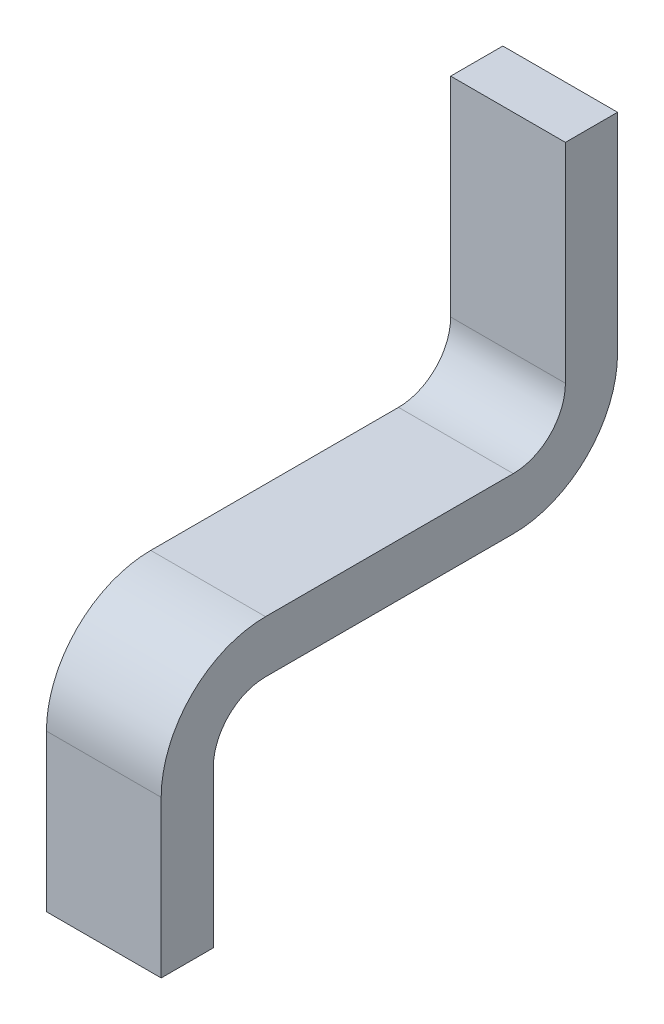
ISO-10303-21;
HEADER;
FILE_DESCRIPTION(('STEP AP214'),'2;1');
FILE_NAME('part.step','',(''),(''),'','','');
FILE_SCHEMA(('AUTOMOTIVE_DESIGN { 1 0 10303 214 1 1 1 1 }'));
ENDSEC;
DATA;
#1=APPLICATION_CONTEXT('core data for automotive mechanical design processes');
#2=APPLICATION_PROTOCOL_DEFINITION('international standard','automotive_design',2000,#1);
#3=PRODUCT_CONTEXT('',#1,'mechanical');
#4=PRODUCT('Part','Part','',(#3));
#5=PRODUCT_RELATED_PRODUCT_CATEGORY('part','',(#4));
#6=PRODUCT_DEFINITION_FORMATION('','',#4);
#7=PRODUCT_DEFINITION_CONTEXT('part definition',#1,'design');
#8=PRODUCT_DEFINITION('design','',#6,#7);
#9=PRODUCT_DEFINITION_SHAPE('','',#8);
#10=(LENGTH_UNIT() NAMED_UNIT(*) SI_UNIT(.MILLI.,.METRE.));
#11=(NAMED_UNIT(*) PLANE_ANGLE_UNIT() SI_UNIT($,.RADIAN.));
#12=(NAMED_UNIT(*) SI_UNIT($,.STERADIAN.) SOLID_ANGLE_UNIT());
#13=UNCERTAINTY_MEASURE_WITH_UNIT(LENGTH_MEASURE(1.E-05),#10,'distance_accuracy_value','');
#14=(GEOMETRIC_REPRESENTATION_CONTEXT(3) GLOBAL_UNCERTAINTY_ASSIGNED_CONTEXT((#13)) GLOBAL_UNIT_ASSIGNED_CONTEXT((#10,
#11,#12)) REPRESENTATION_CONTEXT('',''));
#15=CARTESIAN_POINT('',(0.,0.,0.));
#16=DIRECTION('',(0.,0.,1.));
#17=DIRECTION('',(1.,0.,0.));
#18=AXIS2_PLACEMENT_3D('',#15,#16,#17);
#19=CARTESIAN_POINT('',(2.36,4.,0.675));
#20=DIRECTION('',(-1.,0.,0.));
#21=DIRECTION('',(0.,-1.,0.));
#22=AXIS2_PLACEMENT_3D('',#19,#20,#21);
#23=PLANE('',#22);
#24=CARTESIAN_POINT('',(2.36,3.8,0.675));
#25=DIRECTION('',(1.,0.,0.));
#26=DIRECTION('',(0.,1.,0.));
#27=AXIS2_PLACEMENT_3D('',#24,#25,#26);
#28=CIRCLE('',#27,0.2);
#29=CARTESIAN_POINT('',(2.36,3.8,0.875));
#30=VERTEX_POINT('',#29);
#31=CARTESIAN_POINT('',(2.36,4.,0.675));
#32=VERTEX_POINT('',#31);
#33=EDGE_CURVE('E150',#30,#32,#28,.F.);
#34=ORIENTED_EDGE('',*,*,#33,.F.);
#35=DIRECTION('',(0.,1.,0.));
#36=VECTOR('',#35,1.);
#37=CARTESIAN_POINT('',(2.36,3.5,0.875));
#38=LINE('',#37,#36);
#39=CARTESIAN_POINT('',(2.36,3.5,0.875));
#40=VERTEX_POINT('',#39);
#41=EDGE_CURVE('E147',#30,#40,#38,.F.);
#42=ORIENTED_EDGE('',*,*,#41,.T.);
#43=DIRECTION('',(0.,0.,1.));
#44=VECTOR('',#43,1.);
#45=CARTESIAN_POINT('',(2.36,3.5,0.775));
#46=LINE('',#45,#44);
#47=CARTESIAN_POINT('',(2.36,3.5,0.775));
#48=VERTEX_POINT('',#47);
#49=EDGE_CURVE('E141',#48,#40,#46,.T.);
#50=ORIENTED_EDGE('',*,*,#49,.F.);
#51=DIRECTION('',(0.,1.,0.));
#52=VECTOR('',#51,1.);
#53=CARTESIAN_POINT('',(2.36,3.5,0.775));
#54=LINE('',#53,#52);
#55=CARTESIAN_POINT('',(2.36,3.8,0.775));
#56=VERTEX_POINT('',#55);
#57=EDGE_CURVE('E115',#48,#56,#54,.T.);
#58=ORIENTED_EDGE('',*,*,#57,.T.);
#59=CARTESIAN_POINT('',(2.36,3.8,0.675));
#60=DIRECTION('',(1.,0.,0.));
#61=DIRECTION('',(0.,1.,0.));
#62=AXIS2_PLACEMENT_3D('',#59,#60,#61);
#63=CIRCLE('',#62,0.1);
#64=CARTESIAN_POINT('',(2.36,3.9,0.675));
#65=VERTEX_POINT('',#64);
#66=EDGE_CURVE('E215',#56,#65,#63,.F.);
#67=ORIENTED_EDGE('',*,*,#66,.T.);
#68=DIRECTION('',(0.,0.,1.));
#69=VECTOR('',#68,1.);
#70=CARTESIAN_POINT('',(2.36,3.9,0.675));
#71=LINE('',#70,#69);
#72=CARTESIAN_POINT('',(2.36,3.9,0.2));
#73=VERTEX_POINT('',#72);
#74=EDGE_CURVE('E181',#65,#73,#71,.F.);
#75=ORIENTED_EDGE('',*,*,#74,.T.);
#76=CARTESIAN_POINT('',(2.36,4.1,0.2));
#77=DIRECTION('',(-1.,0.,0.));
#78=DIRECTION('',(0.,-1.,0.));
#79=AXIS2_PLACEMENT_3D('',#76,#77,#78);
#80=CIRCLE('',#79,0.2);
#81=CARTESIAN_POINT('',(2.36,4.1,0.));
#82=VERTEX_POINT('',#81);
#83=EDGE_CURVE('E20',#82,#73,#80,.T.);
#84=ORIENTED_EDGE('',*,*,#83,.F.);
#85=DIRECTION('',(0.,1.,0.));
#86=VECTOR('',#85,1.);
#87=CARTESIAN_POINT('',(2.36,4.1,0.));
#88=LINE('',#87,#86);
#89=CARTESIAN_POINT('',(2.36,4.5,0.));
#90=VERTEX_POINT('',#89);
#91=EDGE_CURVE('E91',#82,#90,#88,.T.);
#92=ORIENTED_EDGE('',*,*,#91,.T.);
#93=DIRECTION('',(0.,0.,1.));
#94=VECTOR('',#93,1.);
#95=CARTESIAN_POINT('',(2.36,4.5,0.));
#96=LINE('',#95,#94);
#97=CARTESIAN_POINT('',(2.36,4.5,0.1));
#98=VERTEX_POINT('',#97);
#99=EDGE_CURVE('E163',#90,#98,#96,.T.);
#100=ORIENTED_EDGE('',*,*,#99,.T.);
#101=DIRECTION('',(0.,1.,0.));
#102=VECTOR('',#101,1.);
#103=CARTESIAN_POINT('',(2.36,4.1,0.1));
#104=LINE('',#103,#102);
#105=CARTESIAN_POINT('',(2.36,4.1,0.1));
#106=VERTEX_POINT('',#105);
#107=EDGE_CURVE('E159',#98,#106,#104,.F.);
#108=ORIENTED_EDGE('',*,*,#107,.T.);
#109=CARTESIAN_POINT('',(2.36,4.1,0.2));
#110=DIRECTION('',(-1.,0.,0.));
#111=DIRECTION('',(0.,-1.,0.));
#112=AXIS2_PLACEMENT_3D('',#109,#110,#111);
#113=CIRCLE('',#112,0.1);
#114=CARTESIAN_POINT('',(2.36,4.,0.2));
#115=VERTEX_POINT('',#114);
#116=EDGE_CURVE('E155',#106,#115,#113,.T.);
#117=ORIENTED_EDGE('',*,*,#116,.T.);
#118=DIRECTION('',(0.,0.,1.));
#119=VECTOR('',#118,1.);
#120=CARTESIAN_POINT('',(2.36,4.,0.675));
#121=LINE('',#120,#119);
#122=EDGE_CURVE('E154',#115,#32,#121,.T.);
#123=ORIENTED_EDGE('',*,*,#122,.T.);
#124=EDGE_LOOP('',(#34,#42,#50,#58,#67,#75,#84,#92,#100,#108,#117,#123));
#125=FACE_BOUND('',#124,.T.);
#126=ADVANCED_FACE('F17',(#125),#23,.F.);
#127=CARTESIAN_POINT('',(2.36,4.1,0.2));
#128=DIRECTION('',(-1.,0.,0.));
#129=DIRECTION('',(0.,-1.,0.));
#130=AXIS2_PLACEMENT_3D('',#127,#128,#129);
#131=CYLINDRICAL_SURFACE('',#130,0.2);
#132=CARTESIAN_POINT('',(2.14,4.1,0.2));
#133=DIRECTION('',(-1.,0.,0.));
#134=DIRECTION('',(0.,-1.,0.));
#135=AXIS2_PLACEMENT_3D('',#132,#133,#134);
#136=CIRCLE('',#135,0.2);
#137=CARTESIAN_POINT('',(2.14,3.9,0.2));
#138=VERTEX_POINT('',#137);
#139=CARTESIAN_POINT('',(2.14,4.1,0.));
#140=VERTEX_POINT('',#139);
#141=EDGE_CURVE('E183',#138,#140,#136,.F.);
#142=ORIENTED_EDGE('',*,*,#141,.T.);
#143=DIRECTION('',(1.,0.,0.));
#144=VECTOR('',#143,1.);
#145=CARTESIAN_POINT('',(2.36,4.1,0.));
#146=LINE('',#145,#144);
#147=EDGE_CURVE('E178',#140,#82,#146,.T.);
#148=ORIENTED_EDGE('',*,*,#147,.T.);
#149=ORIENTED_EDGE('',*,*,#83,.T.);
#150=DIRECTION('',(-1.,0.,0.));
#151=VECTOR('',#150,1.);
#152=CARTESIAN_POINT('',(2.36,3.9,0.2));
#153=LINE('',#152,#151);
#154=EDGE_CURVE('E217',#73,#138,#153,.T.);
#155=ORIENTED_EDGE('',*,*,#154,.T.);
#156=EDGE_LOOP('',(#142,#148,#149,#155));
#157=FACE_BOUND('',#156,.T.);
#158=ADVANCED_FACE('F254',(#157),#131,.T.);
#159=CARTESIAN_POINT('',(2.36,4.1,0.));
#160=DIRECTION('',(0.,0.,1.));
#161=DIRECTION('',(1.,0.,0.));
#162=AXIS2_PLACEMENT_3D('',#159,#160,#161);
#163=PLANE('',#162);
#164=ORIENTED_EDGE('',*,*,#147,.F.);
#165=DIRECTION('',(0.,1.,0.));
#166=VECTOR('',#165,1.);
#167=CARTESIAN_POINT('',(2.14,3.9,0.));
#168=LINE('',#167,#166);
#169=CARTESIAN_POINT('',(2.14,4.5,0.));
#170=VERTEX_POINT('',#169);
#171=EDGE_CURVE('E170',#140,#170,#168,.T.);
#172=ORIENTED_EDGE('',*,*,#171,.T.);
#173=DIRECTION('',(1.,0.,0.));
#174=VECTOR('',#173,1.);
#175=CARTESIAN_POINT('',(2.36,4.5,0.));
#176=LINE('',#175,#174);
#177=EDGE_CURVE('E173',#170,#90,#176,.T.);
#178=ORIENTED_EDGE('',*,*,#177,.T.);
#179=ORIENTED_EDGE('',*,*,#91,.F.);
#180=EDGE_LOOP('',(#164,#172,#178,#179));
#181=FACE_BOUND('',#180,.T.);
#182=ADVANCED_FACE('F257',(#181),#163,.F.);
#183=CARTESIAN_POINT('',(2.36,4.5,0.));
#184=DIRECTION('',(0.,-1.,0.));
#185=DIRECTION('',(1.,0.,0.));
#186=AXIS2_PLACEMENT_3D('',#183,#184,#185);
#187=PLANE('',#186);
#188=DIRECTION('',(-1.,0.,0.));
#189=VECTOR('',#188,1.);
#190=CARTESIAN_POINT('',(2.14,4.5,0.1));
#191=LINE('',#190,#189);
#192=CARTESIAN_POINT('',(2.14,4.5,0.1));
#193=VERTEX_POINT('',#192);
#194=EDGE_CURVE('E160',#193,#98,#191,.F.);
#195=ORIENTED_EDGE('',*,*,#194,.T.);
#196=ORIENTED_EDGE('',*,*,#99,.F.);
#197=ORIENTED_EDGE('',*,*,#177,.F.);
#198=DIRECTION('',(0.,0.,1.));
#199=VECTOR('',#198,1.);
#200=CARTESIAN_POINT('',(2.14,4.5,0.675));
#201=LINE('',#200,#199);
#202=EDGE_CURVE('E166',#170,#193,#201,.T.);
#203=ORIENTED_EDGE('',*,*,#202,.T.);
#204=EDGE_LOOP('',(#195,#196,#197,#203));
#205=FACE_BOUND('',#204,.T.);
#206=ADVANCED_FACE('F259',(#205),#187,.F.);
#207=CARTESIAN_POINT('',(2.14,4.1,0.1));
#208=DIRECTION('',(0.,0.,-1.));
#209=DIRECTION('',(-1.,0.,0.));
#210=AXIS2_PLACEMENT_3D('',#207,#208,#209);
#211=PLANE('',#210);
#212=DIRECTION('',(-1.,0.,0.));
#213=VECTOR('',#212,1.);
#214=CARTESIAN_POINT('',(2.14,4.1,0.1));
#215=LINE('',#214,#213);
#216=CARTESIAN_POINT('',(2.14,4.1,0.1));
#217=VERTEX_POINT('',#216);
#218=EDGE_CURVE('E156',#217,#106,#215,.F.);
#219=ORIENTED_EDGE('',*,*,#218,.T.);
#220=ORIENTED_EDGE('',*,*,#107,.F.);
#221=ORIENTED_EDGE('',*,*,#194,.F.);
#222=DIRECTION('',(0.,1.,0.));
#223=VECTOR('',#222,1.);
#224=CARTESIAN_POINT('',(2.14,3.9,0.1));
#225=LINE('',#224,#223);
#226=EDGE_CURVE('E169',#193,#217,#225,.F.);
#227=ORIENTED_EDGE('',*,*,#226,.T.);
#228=EDGE_LOOP('',(#219,#220,#221,#227));
#229=FACE_BOUND('',#228,.T.);
#230=ADVANCED_FACE('F234',(#229),#211,.F.);
#231=CARTESIAN_POINT('',(2.14,4.1,0.2));
#232=DIRECTION('',(-1.,0.,0.));
#233=DIRECTION('',(0.,-1.,0.));
#234=AXIS2_PLACEMENT_3D('',#231,#232,#233);
#235=CYLINDRICAL_SURFACE('',#234,0.1);
#236=DIRECTION('',(1.,0.,0.));
#237=VECTOR('',#236,1.);
#238=CARTESIAN_POINT('',(2.14,4.,0.2));
#239=LINE('',#238,#237);
#240=CARTESIAN_POINT('',(2.14,4.,0.2));
#241=VERTEX_POINT('',#240);
#242=EDGE_CURVE('E151',#241,#115,#239,.T.);
#243=ORIENTED_EDGE('',*,*,#242,.T.);
#244=ORIENTED_EDGE('',*,*,#116,.F.);
#245=ORIENTED_EDGE('',*,*,#218,.F.);
#246=CARTESIAN_POINT('',(2.14,4.1,0.2));
#247=DIRECTION('',(-1.,0.,0.));
#248=DIRECTION('',(0.,-1.,0.));
#249=AXIS2_PLACEMENT_3D('',#246,#247,#248);
#250=CIRCLE('',#249,0.1);
#251=EDGE_CURVE('E210',#217,#241,#250,.T.);
#252=ORIENTED_EDGE('',*,*,#251,.T.);
#253=EDGE_LOOP('',(#243,#244,#245,#252));
#254=FACE_BOUND('',#253,.T.);
#255=ADVANCED_FACE('F227',(#254),#235,.F.);
#256=CARTESIAN_POINT('',(2.14,4.,0.675));
#257=DIRECTION('',(0.,-1.,0.));
#258=DIRECTION('',(1.,0.,0.));
#259=AXIS2_PLACEMENT_3D('',#256,#257,#258);
#260=PLANE('',#259);
#261=DIRECTION('',(1.,0.,0.));
#262=VECTOR('',#261,1.);
#263=CARTESIAN_POINT('',(2.14,4.,0.675));
#264=LINE('',#263,#262);
#265=CARTESIAN_POINT('',(2.14,4.,0.675));
#266=VERTEX_POINT('',#265);
#267=EDGE_CURVE('E148',#32,#266,#264,.F.);
#268=ORIENTED_EDGE('',*,*,#267,.F.);
#269=ORIENTED_EDGE('',*,*,#122,.F.);
#270=ORIENTED_EDGE('',*,*,#242,.F.);
#271=DIRECTION('',(0.,0.,1.));
#272=VECTOR('',#271,1.);
#273=CARTESIAN_POINT('',(2.14,4.,0.675));
#274=LINE('',#273,#272);
#275=EDGE_CURVE('E209',#241,#266,#274,.T.);
#276=ORIENTED_EDGE('',*,*,#275,.T.);
#277=EDGE_LOOP('',(#268,#269,#270,#276));
#278=FACE_BOUND('',#277,.T.);
#279=ADVANCED_FACE('F224',(#278),#260,.F.);
#280=CARTESIAN_POINT('',(2.14,3.8,0.675));
#281=DIRECTION('',(1.,0.,0.));
#282=DIRECTION('',(0.,1.,0.));
#283=AXIS2_PLACEMENT_3D('',#280,#281,#282);
#284=CYLINDRICAL_SURFACE('',#283,0.2);
#285=ORIENTED_EDGE('',*,*,#33,.T.);
#286=ORIENTED_EDGE('',*,*,#267,.T.);
#287=CARTESIAN_POINT('',(2.14,3.8,0.675));
#288=DIRECTION('',(1.,0.,0.));
#289=DIRECTION('',(0.,1.,0.));
#290=AXIS2_PLACEMENT_3D('',#287,#288,#289);
#291=CIRCLE('',#290,0.2);
#292=CARTESIAN_POINT('',(2.14,3.8,0.875));
#293=VERTEX_POINT('',#292);
#294=EDGE_CURVE('E133',#266,#293,#291,.T.);
#295=ORIENTED_EDGE('',*,*,#294,.T.);
#296=DIRECTION('',(-1.,0.,0.));
#297=VECTOR('',#296,1.);
#298=CARTESIAN_POINT('',(2.14,3.8,0.875));
#299=LINE('',#298,#297);
#300=EDGE_CURVE('E144',#293,#30,#299,.F.);
#301=ORIENTED_EDGE('',*,*,#300,.T.);
#302=EDGE_LOOP('',(#285,#286,#295,#301));
#303=FACE_BOUND('',#302,.T.);
#304=ADVANCED_FACE('F285',(#303),#284,.T.);
#305=CARTESIAN_POINT('',(2.14,3.5,0.875));
#306=DIRECTION('',(0.,0.,-1.));
#307=DIRECTION('',(-1.,0.,0.));
#308=AXIS2_PLACEMENT_3D('',#305,#306,#307);
#309=PLANE('',#308);
#310=DIRECTION('',(1.,0.,0.));
#311=VECTOR('',#310,1.);
#312=CARTESIAN_POINT('',(2.36,3.5,0.875));
#313=LINE('',#312,#311);
#314=CARTESIAN_POINT('',(2.14,3.5,0.875));
#315=VERTEX_POINT('',#314);
#316=EDGE_CURVE('E118',#40,#315,#313,.F.);
#317=ORIENTED_EDGE('',*,*,#316,.F.);
#318=ORIENTED_EDGE('',*,*,#41,.F.);
#319=ORIENTED_EDGE('',*,*,#300,.F.);
#320=DIRECTION('',(0.,1.,0.));
#321=VECTOR('',#320,1.);
#322=CARTESIAN_POINT('',(2.14,3.9,0.875));
#323=LINE('',#322,#321);
#324=EDGE_CURVE('E131',#293,#315,#323,.F.);
#325=ORIENTED_EDGE('',*,*,#324,.T.);
#326=EDGE_LOOP('',(#317,#318,#319,#325));
#327=FACE_BOUND('',#326,.T.);
#328=ADVANCED_FACE('F282',(#327),#309,.F.);
#329=CARTESIAN_POINT('',(2.36,3.5,0.775));
#330=DIRECTION('',(0.,-1.,0.));
#331=DIRECTION('',(1.,0.,0.));
#332=AXIS2_PLACEMENT_3D('',#329,#330,#331);
#333=PLANE('',#332);
#334=ORIENTED_EDGE('',*,*,#49,.T.);
#335=ORIENTED_EDGE('',*,*,#316,.T.);
#336=DIRECTION('',(0.,0.,1.));
#337=VECTOR('',#336,1.);
#338=CARTESIAN_POINT('',(2.14,3.5,0.675));
#339=LINE('',#338,#337);
#340=CARTESIAN_POINT('',(2.14,3.5,0.775));
#341=VERTEX_POINT('',#340);
#342=EDGE_CURVE('E125',#315,#341,#339,.F.);
#343=ORIENTED_EDGE('',*,*,#342,.T.);
#344=DIRECTION('',(1.,0.,0.));
#345=VECTOR('',#344,1.);
#346=CARTESIAN_POINT('',(2.36,3.5,0.775));
#347=LINE('',#346,#345);
#348=EDGE_CURVE('E110',#341,#48,#347,.T.);
#349=ORIENTED_EDGE('',*,*,#348,.T.);
#350=EDGE_LOOP('',(#334,#335,#343,#349));
#351=FACE_BOUND('',#350,.T.);
#352=ADVANCED_FACE('F129',(#351),#333,.T.);
#353=CARTESIAN_POINT('',(2.36,3.5,0.775));
#354=DIRECTION('',(0.,0.,1.));
#355=DIRECTION('',(1.,0.,0.));
#356=AXIS2_PLACEMENT_3D('',#353,#354,#355);
#357=PLANE('',#356);
#358=ORIENTED_EDGE('',*,*,#348,.F.);
#359=DIRECTION('',(0.,1.,0.));
#360=VECTOR('',#359,1.);
#361=CARTESIAN_POINT('',(2.14,3.9,0.775));
#362=LINE('',#361,#360);
#363=CARTESIAN_POINT('',(2.14,3.8,0.775));
#364=VERTEX_POINT('',#363);
#365=EDGE_CURVE('E114',#341,#364,#362,.T.);
#366=ORIENTED_EDGE('',*,*,#365,.T.);
#367=DIRECTION('',(1.,0.,0.));
#368=VECTOR('',#367,1.);
#369=CARTESIAN_POINT('',(2.36,3.8,0.775));
#370=LINE('',#369,#368);
#371=EDGE_CURVE('E185',#364,#56,#370,.T.);
#372=ORIENTED_EDGE('',*,*,#371,.T.);
#373=ORIENTED_EDGE('',*,*,#57,.F.);
#374=EDGE_LOOP('',(#358,#366,#372,#373));
#375=FACE_BOUND('',#374,.T.);
#376=ADVANCED_FACE('F112',(#375),#357,.F.);
#377=CARTESIAN_POINT('',(2.36,3.8,0.675));
#378=DIRECTION('',(1.,0.,0.));
#379=DIRECTION('',(0.,1.,0.));
#380=AXIS2_PLACEMENT_3D('',#377,#378,#379);
#381=CYLINDRICAL_SURFACE('',#380,0.1);
#382=ORIENTED_EDGE('',*,*,#371,.F.);
#383=CARTESIAN_POINT('',(2.14,3.8,0.675));
#384=DIRECTION('',(1.,0.,0.));
#385=DIRECTION('',(0.,1.,0.));
#386=AXIS2_PLACEMENT_3D('',#383,#384,#385);
#387=CIRCLE('',#386,0.1);
#388=CARTESIAN_POINT('',(2.14,3.9,0.675));
#389=VERTEX_POINT('',#388);
#390=EDGE_CURVE('E26',#364,#389,#387,.F.);
#391=ORIENTED_EDGE('',*,*,#390,.T.);
#392=DIRECTION('',(-1.,0.,0.));
#393=VECTOR('',#392,1.);
#394=CARTESIAN_POINT('',(2.36,3.9,0.675));
#395=LINE('',#394,#393);
#396=EDGE_CURVE('E34',#389,#65,#395,.F.);
#397=ORIENTED_EDGE('',*,*,#396,.T.);
#398=ORIENTED_EDGE('',*,*,#66,.F.);
#399=EDGE_LOOP('',(#382,#391,#397,#398));
#400=FACE_BOUND('',#399,.T.);
#401=ADVANCED_FACE('F250',(#400),#381,.F.);
#402=CARTESIAN_POINT('',(2.36,3.9,0.675));
#403=DIRECTION('',(0.,1.,0.));
#404=DIRECTION('',(-1.,0.,0.));
#405=AXIS2_PLACEMENT_3D('',#402,#403,#404);
#406=PLANE('',#405);
#407=ORIENTED_EDGE('',*,*,#396,.F.);
#408=DIRECTION('',(0.,0.,1.));
#409=VECTOR('',#408,1.);
#410=CARTESIAN_POINT('',(2.14,3.9,0.675));
#411=LINE('',#410,#409);
#412=EDGE_CURVE('E11',#389,#138,#411,.F.);
#413=ORIENTED_EDGE('',*,*,#412,.T.);
#414=ORIENTED_EDGE('',*,*,#154,.F.);
#415=ORIENTED_EDGE('',*,*,#74,.F.);
#416=EDGE_LOOP('',(#407,#413,#414,#415));
#417=FACE_BOUND('',#416,.T.);
#418=ADVANCED_FACE('F252',(#417),#406,.F.);
#419=CARTESIAN_POINT('',(2.14,3.9,0.675));
#420=DIRECTION('',(1.,0.,0.));
#421=DIRECTION('',(0.,1.,0.));
#422=AXIS2_PLACEMENT_3D('',#419,#420,#421);
#423=PLANE('',#422);
#424=ORIENTED_EDGE('',*,*,#390,.F.);
#425=ORIENTED_EDGE('',*,*,#365,.F.);
#426=ORIENTED_EDGE('',*,*,#342,.F.);
#427=ORIENTED_EDGE('',*,*,#324,.F.);
#428=ORIENTED_EDGE('',*,*,#294,.F.);
#429=ORIENTED_EDGE('',*,*,#275,.F.);
#430=ORIENTED_EDGE('',*,*,#251,.F.);
#431=ORIENTED_EDGE('',*,*,#226,.F.);
#432=ORIENTED_EDGE('',*,*,#202,.F.);
#433=ORIENTED_EDGE('',*,*,#171,.F.);
#434=ORIENTED_EDGE('',*,*,#141,.F.);
#435=ORIENTED_EDGE('',*,*,#412,.F.);
#436=EDGE_LOOP('',(#424,#425,#426,#427,#428,#429,#430,#431,#432,#433,#434,#435));
#437=FACE_BOUND('',#436,.T.);
#438=ADVANCED_FACE('F123',(#437),#423,.F.);
#439=CLOSED_SHELL('',(#126,#158,#182,#206,#230,#255,#279,#304,#328,#352,#376,#401,#418,#438));
#440=MANIFOLD_SOLID_BREP('B1',#439);
#441=ADVANCED_BREP_SHAPE_REPRESENTATION('',(#18,#440),#14);
#442=SHAPE_DEFINITION_REPRESENTATION(#9,#441);
ENDSEC;
END-ISO-10303-21;
